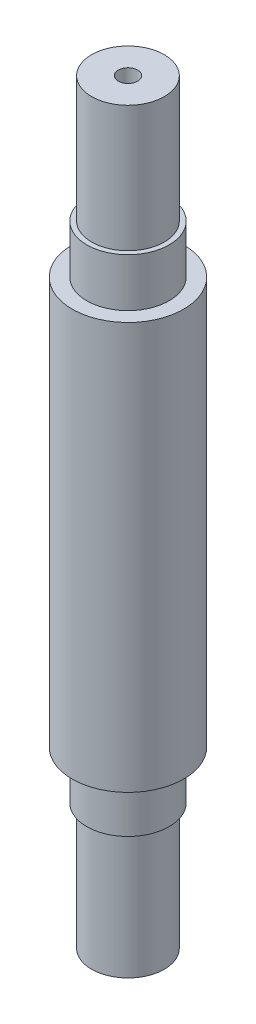
ISO-10303-21;
HEADER;
FILE_DESCRIPTION(('STEP AP214'),'2;1');
FILE_NAME('part.step','',(''),(''),'','','');
FILE_SCHEMA(('AUTOMOTIVE_DESIGN { 1 0 10303 214 1 1 1 1 }'));
ENDSEC;
DATA;
#1=APPLICATION_CONTEXT('core data for automotive mechanical design processes');
#2=APPLICATION_PROTOCOL_DEFINITION('international standard','automotive_design',2000,#1);
#3=PRODUCT_CONTEXT('',#1,'mechanical');
#4=PRODUCT('Part','Part','',(#3));
#5=PRODUCT_RELATED_PRODUCT_CATEGORY('part','',(#4));
#6=PRODUCT_DEFINITION_FORMATION('','',#4);
#7=PRODUCT_DEFINITION_CONTEXT('part definition',#1,'design');
#8=PRODUCT_DEFINITION('design','',#6,#7);
#9=PRODUCT_DEFINITION_SHAPE('','',#8);
#10=(LENGTH_UNIT() NAMED_UNIT(*) SI_UNIT(.MILLI.,.METRE.));
#11=(NAMED_UNIT(*) PLANE_ANGLE_UNIT() SI_UNIT($,.RADIAN.));
#12=(NAMED_UNIT(*) SI_UNIT($,.STERADIAN.) SOLID_ANGLE_UNIT());
#13=UNCERTAINTY_MEASURE_WITH_UNIT(LENGTH_MEASURE(1.E-05),#10,'distance_accuracy_value','');
#14=(GEOMETRIC_REPRESENTATION_CONTEXT(3) GLOBAL_UNCERTAINTY_ASSIGNED_CONTEXT((#13)) GLOBAL_UNIT_ASSIGNED_CONTEXT((#10,
#11,#12)) REPRESENTATION_CONTEXT('',''));
#15=CARTESIAN_POINT('',(0.,0.,0.));
#16=DIRECTION('',(0.,0.,1.));
#17=DIRECTION('',(1.,0.,0.));
#18=AXIS2_PLACEMENT_3D('',#15,#16,#17);
#19=CARTESIAN_POINT('',(0.,29.4619524825848,0.));
#20=DIRECTION('',(0.,1.,0.));
#21=DIRECTION('',(-1.,0.,0.));
#22=AXIS2_PLACEMENT_3D('',#19,#20,#21);
#23=CONICAL_SURFACE('',#22,1.00000000000001,0.78539816339744);
#24=CARTESIAN_POINT('',(0.,28.4619524825848,0.));
#25=VERTEX_POINT('',#24);
#26=VERTEX_LOOP('',#25);
#27=FACE_BOUND('',#26,.T.);
#28=CARTESIAN_POINT('',(0.,29.4619524825848,0.));
#29=DIRECTION('',(0.,1.,0.));
#30=DIRECTION('',(-1.,0.,0.));
#31=AXIS2_PLACEMENT_3D('',#28,#29,#30);
#32=CIRCLE('',#31,1.00000000000001);
#33=CARTESIAN_POINT('',(-1.00000000000001,29.4619524825848,0.));
#34=VERTEX_POINT('',#33);
#35=EDGE_CURVE('E11',#34,#34,#32,.T.);
#36=ORIENTED_EDGE('',*,*,#35,.T.);
#37=EDGE_LOOP('',(#36));
#38=FACE_BOUND('',#37,.T.);
#39=ADVANCED_FACE('F36',(#27,#38),#23,.F.);
#40=CARTESIAN_POINT('',(0.,28.4619524825848,0.));
#41=DIRECTION('',(0.,1.,0.));
#42=DIRECTION('',(-1.,0.,0.));
#43=AXIS2_PLACEMENT_3D('',#40,#41,#42);
#44=CYLINDRICAL_SURFACE('',#43,1.00000000000001);
#45=ORIENTED_EDGE('',*,*,#35,.F.);
#46=EDGE_LOOP('',(#45));
#47=FACE_BOUND('',#46,.T.);
#48=CARTESIAN_POINT('',(0.,32.4619524825848,0.));
#49=DIRECTION('',(0.,1.,0.));
#50=DIRECTION('',(-1.,0.,0.));
#51=AXIS2_PLACEMENT_3D('',#48,#49,#50);
#52=CIRCLE('',#51,1.00000000000001);
#53=CARTESIAN_POINT('',(-1.00000000000001,32.4619524825848,0.));
#54=VERTEX_POINT('',#53);
#55=EDGE_CURVE('E43',#54,#54,#52,.T.);
#56=ORIENTED_EDGE('',*,*,#55,.T.);
#57=EDGE_LOOP('',(#56));
#58=FACE_BOUND('',#57,.T.);
#59=ADVANCED_FACE('F51',(#47,#58),#44,.F.);
#60=CARTESIAN_POINT('',(1.00000000000001,32.4619524825848,0.));
#61=DIRECTION('',(0.,-1.,0.));
#62=DIRECTION('',(1.,0.,0.));
#63=AXIS2_PLACEMENT_3D('',#60,#61,#62);
#64=PLANE('',#63);
#65=ORIENTED_EDGE('',*,*,#55,.F.);
#66=EDGE_LOOP('',(#65));
#67=FACE_BOUND('',#66,.T.);
#68=CARTESIAN_POINT('',(0.,32.4619524825848,0.));
#69=DIRECTION('',(0.,1.,0.));
#70=DIRECTION('',(-1.,0.,0.));
#71=AXIS2_PLACEMENT_3D('',#68,#69,#70);
#72=CIRCLE('',#71,3.75);
#73=CARTESIAN_POINT('',(-3.75,32.4619524825848,0.));
#74=VERTEX_POINT('',#73);
#75=EDGE_CURVE('E60',#74,#74,#72,.T.);
#76=ORIENTED_EDGE('',*,*,#75,.T.);
#77=EDGE_LOOP('',(#76));
#78=FACE_BOUND('',#77,.T.);
#79=ADVANCED_FACE('F56',(#67,#78),#64,.F.);
#80=CARTESIAN_POINT('',(0.,28.4619524825848,0.));
#81=DIRECTION('',(0.,1.,0.));
#82=DIRECTION('',(-1.,0.,0.));
#83=AXIS2_PLACEMENT_3D('',#80,#81,#82);
#84=CYLINDRICAL_SURFACE('',#83,3.75);
#85=ORIENTED_EDGE('',*,*,#75,.F.);
#86=EDGE_LOOP('',(#85));
#87=FACE_BOUND('',#86,.T.);
#88=CARTESIAN_POINT('',(0.,19.4619524825848,0.));
#89=DIRECTION('',(0.,1.,0.));
#90=DIRECTION('',(-1.,0.,0.));
#91=AXIS2_PLACEMENT_3D('',#88,#89,#90);
#92=CIRCLE('',#91,3.75);
#93=CARTESIAN_POINT('',(-3.75,19.4619524825848,0.));
#94=VERTEX_POINT('',#93);
#95=EDGE_CURVE('E62',#94,#94,#92,.T.);
#96=ORIENTED_EDGE('',*,*,#95,.T.);
#97=EDGE_LOOP('',(#96));
#98=FACE_BOUND('',#97,.T.);
#99=ADVANCED_FACE('F144',(#87,#98),#84,.T.);
#100=CARTESIAN_POINT('',(4.25,19.4619524825848,0.));
#101=DIRECTION('',(0.,-1.,0.));
#102=DIRECTION('',(1.,0.,0.));
#103=AXIS2_PLACEMENT_3D('',#100,#101,#102);
#104=PLANE('',#103);
#105=ORIENTED_EDGE('',*,*,#95,.F.);
#106=EDGE_LOOP('',(#105));
#107=FACE_BOUND('',#106,.T.);
#108=CARTESIAN_POINT('',(0.,19.4619524825848,0.));
#109=DIRECTION('',(0.,1.,0.));
#110=DIRECTION('',(-1.,0.,0.));
#111=AXIS2_PLACEMENT_3D('',#108,#109,#110);
#112=CIRCLE('',#111,4.25);
#113=CARTESIAN_POINT('',(-4.25,19.4619524825848,0.));
#114=VERTEX_POINT('',#113);
#115=EDGE_CURVE('E67',#114,#114,#112,.T.);
#116=ORIENTED_EDGE('',*,*,#115,.T.);
#117=EDGE_LOOP('',(#116));
#118=FACE_BOUND('',#117,.T.);
#119=ADVANCED_FACE('F140',(#107,#118),#104,.F.);
#120=CARTESIAN_POINT('',(0.,28.4619524825848,0.));
#121=DIRECTION('',(0.,1.,0.));
#122=DIRECTION('',(-1.,0.,0.));
#123=AXIS2_PLACEMENT_3D('',#120,#121,#122);
#124=CYLINDRICAL_SURFACE('',#123,4.25);
#125=ORIENTED_EDGE('',*,*,#115,.F.);
#126=EDGE_LOOP('',(#125));
#127=FACE_BOUND('',#126,.T.);
#128=CARTESIAN_POINT('',(0.,14.4619524825848,0.));
#129=DIRECTION('',(0.,1.,0.));
#130=DIRECTION('',(-1.,0.,0.));
#131=AXIS2_PLACEMENT_3D('',#128,#129,#130);
#132=CIRCLE('',#131,4.25);
#133=CARTESIAN_POINT('',(-4.25,14.4619524825848,0.));
#134=VERTEX_POINT('',#133);
#135=EDGE_CURVE('E70',#134,#134,#132,.T.);
#136=ORIENTED_EDGE('',*,*,#135,.T.);
#137=EDGE_LOOP('',(#136));
#138=FACE_BOUND('',#137,.T.);
#139=ADVANCED_FACE('F136',(#127,#138),#124,.T.);
#140=CARTESIAN_POINT('',(4.25,14.4619524825848,0.));
#141=DIRECTION('',(0.,-1.,0.));
#142=DIRECTION('',(1.,0.,0.));
#143=AXIS2_PLACEMENT_3D('',#140,#141,#142);
#144=PLANE('',#143);
#145=ORIENTED_EDGE('',*,*,#135,.F.);
#146=EDGE_LOOP('',(#145));
#147=FACE_BOUND('',#146,.T.);
#148=CARTESIAN_POINT('',(0.,14.4619524825848,0.));
#149=DIRECTION('',(0.,1.,0.));
#150=DIRECTION('',(-1.,0.,0.));
#151=AXIS2_PLACEMENT_3D('',#148,#149,#150);
#152=CIRCLE('',#151,5.75);
#153=CARTESIAN_POINT('',(-5.75,14.4619524825848,0.));
#154=VERTEX_POINT('',#153);
#155=EDGE_CURVE('E73',#154,#154,#152,.T.);
#156=ORIENTED_EDGE('',*,*,#155,.T.);
#157=EDGE_LOOP('',(#156));
#158=FACE_BOUND('',#157,.T.);
#159=ADVANCED_FACE('F132',(#147,#158),#144,.F.);
#160=CARTESIAN_POINT('',(0.,28.4619524825848,0.));
#161=DIRECTION('',(0.,1.,0.));
#162=DIRECTION('',(-1.,0.,0.));
#163=AXIS2_PLACEMENT_3D('',#160,#161,#162);
#164=CYLINDRICAL_SURFACE('',#163,5.75);
#165=ORIENTED_EDGE('',*,*,#155,.F.);
#166=EDGE_LOOP('',(#165));
#167=FACE_BOUND('',#166,.T.);
#168=CARTESIAN_POINT('',(0.,-27.5380475174152,0.));
#169=DIRECTION('',(0.,1.,0.));
#170=DIRECTION('',(-1.,0.,0.));
#171=AXIS2_PLACEMENT_3D('',#168,#169,#170);
#172=CIRCLE('',#171,5.75000000000001);
#173=CARTESIAN_POINT('',(-5.75000000000001,-27.5380475174152,0.));
#174=VERTEX_POINT('',#173);
#175=EDGE_CURVE('E76',#174,#174,#172,.T.);
#176=ORIENTED_EDGE('',*,*,#175,.T.);
#177=EDGE_LOOP('',(#176));
#178=FACE_BOUND('',#177,.T.);
#179=ADVANCED_FACE('F128',(#167,#178),#164,.T.);
#180=CARTESIAN_POINT('',(5.75000000000001,-27.5380475174152,0.));
#181=DIRECTION('',(0.,1.,0.));
#182=DIRECTION('',(-1.,0.,0.));
#183=AXIS2_PLACEMENT_3D('',#180,#181,#182);
#184=PLANE('',#183);
#185=ORIENTED_EDGE('',*,*,#175,.F.);
#186=EDGE_LOOP('',(#185));
#187=FACE_BOUND('',#186,.T.);
#188=CARTESIAN_POINT('',(0.,-27.5380475174152,0.));
#189=DIRECTION('',(0.,1.,0.));
#190=DIRECTION('',(-1.,0.,0.));
#191=AXIS2_PLACEMENT_3D('',#188,#189,#190);
#192=CIRCLE('',#191,4.25000000000001);
#193=CARTESIAN_POINT('',(-4.25000000000001,-27.5380475174152,0.));
#194=VERTEX_POINT('',#193);
#195=EDGE_CURVE('E79',#194,#194,#192,.T.);
#196=ORIENTED_EDGE('',*,*,#195,.T.);
#197=EDGE_LOOP('',(#196));
#198=FACE_BOUND('',#197,.T.);
#199=ADVANCED_FACE('F124',(#187,#198),#184,.F.);
#200=CARTESIAN_POINT('',(0.,28.4619524825848,0.));
#201=DIRECTION('',(0.,1.,0.));
#202=DIRECTION('',(-1.,0.,0.));
#203=AXIS2_PLACEMENT_3D('',#200,#201,#202);
#204=CYLINDRICAL_SURFACE('',#203,4.25000000000001);
#205=ORIENTED_EDGE('',*,*,#195,.F.);
#206=EDGE_LOOP('',(#205));
#207=FACE_BOUND('',#206,.T.);
#208=CARTESIAN_POINT('',(0.,-32.5380475174152,0.));
#209=DIRECTION('',(0.,1.,0.));
#210=DIRECTION('',(-1.,0.,0.));
#211=AXIS2_PLACEMENT_3D('',#208,#209,#210);
#212=CIRCLE('',#211,4.25000000000001);
#213=CARTESIAN_POINT('',(-4.25000000000001,-32.5380475174152,0.));
#214=VERTEX_POINT('',#213);
#215=EDGE_CURVE('E82',#214,#214,#212,.T.);
#216=ORIENTED_EDGE('',*,*,#215,.T.);
#217=EDGE_LOOP('',(#216));
#218=FACE_BOUND('',#217,.T.);
#219=ADVANCED_FACE('F120',(#207,#218),#204,.T.);
#220=CARTESIAN_POINT('',(4.25000000000001,-32.5380475174152,0.));
#221=DIRECTION('',(0.,1.,0.));
#222=DIRECTION('',(-1.,0.,0.));
#223=AXIS2_PLACEMENT_3D('',#220,#221,#222);
#224=PLANE('',#223);
#225=ORIENTED_EDGE('',*,*,#215,.F.);
#226=EDGE_LOOP('',(#225));
#227=FACE_BOUND('',#226,.T.);
#228=CARTESIAN_POINT('',(0.,-32.5380475174152,0.));
#229=DIRECTION('',(0.,1.,0.));
#230=DIRECTION('',(-1.,0.,0.));
#231=AXIS2_PLACEMENT_3D('',#228,#229,#230);
#232=CIRCLE('',#231,3.75);
#233=CARTESIAN_POINT('',(-3.75,-32.5380475174152,0.));
#234=VERTEX_POINT('',#233);
#235=EDGE_CURVE('E85',#234,#234,#232,.T.);
#236=ORIENTED_EDGE('',*,*,#235,.T.);
#237=EDGE_LOOP('',(#236));
#238=FACE_BOUND('',#237,.T.);
#239=ADVANCED_FACE('F116',(#227,#238),#224,.F.);
#240=CARTESIAN_POINT('',(0.,28.4619524825848,0.));
#241=DIRECTION('',(0.,1.,0.));
#242=DIRECTION('',(-1.,0.,0.));
#243=AXIS2_PLACEMENT_3D('',#240,#241,#242);
#244=CYLINDRICAL_SURFACE('',#243,3.75);
#245=ORIENTED_EDGE('',*,*,#235,.F.);
#246=EDGE_LOOP('',(#245));
#247=FACE_BOUND('',#246,.T.);
#248=CARTESIAN_POINT('',(0.,-45.5380475174152,0.));
#249=DIRECTION('',(0.,1.,0.));
#250=DIRECTION('',(-1.,0.,0.));
#251=AXIS2_PLACEMENT_3D('',#248,#249,#250);
#252=CIRCLE('',#251,3.75);
#253=CARTESIAN_POINT('',(-3.75,-45.5380475174152,0.));
#254=VERTEX_POINT('',#253);
#255=EDGE_CURVE('E88',#254,#254,#252,.T.);
#256=ORIENTED_EDGE('',*,*,#255,.T.);
#257=EDGE_LOOP('',(#256));
#258=FACE_BOUND('',#257,.T.);
#259=ADVANCED_FACE('F112',(#247,#258),#244,.T.);
#260=CARTESIAN_POINT('',(3.75,-45.5380475174152,0.));
#261=DIRECTION('',(0.,1.,0.));
#262=DIRECTION('',(-1.,0.,0.));
#263=AXIS2_PLACEMENT_3D('',#260,#261,#262);
#264=PLANE('',#263);
#265=ORIENTED_EDGE('',*,*,#255,.F.);
#266=EDGE_LOOP('',(#265));
#267=FACE_BOUND('',#266,.T.);
#268=CARTESIAN_POINT('',(0.,-45.5380475174152,0.));
#269=DIRECTION('',(0.,1.,0.));
#270=DIRECTION('',(-1.,0.,0.));
#271=AXIS2_PLACEMENT_3D('',#268,#269,#270);
#272=CIRCLE('',#271,1.00000000000003);
#273=CARTESIAN_POINT('',(-1.00000000000003,-45.5380475174152,0.));
#274=VERTEX_POINT('',#273);
#275=EDGE_CURVE('E91',#274,#274,#272,.T.);
#276=ORIENTED_EDGE('',*,*,#275,.T.);
#277=EDGE_LOOP('',(#276));
#278=FACE_BOUND('',#277,.T.);
#279=ADVANCED_FACE('F106',(#267,#278),#264,.F.);
#280=CARTESIAN_POINT('',(0.,28.4619524825848,0.));
#281=DIRECTION('',(0.,1.,0.));
#282=DIRECTION('',(-1.,0.,0.));
#283=AXIS2_PLACEMENT_3D('',#280,#281,#282);
#284=CYLINDRICAL_SURFACE('',#283,1.00000000000003);
#285=ORIENTED_EDGE('',*,*,#275,.F.);
#286=EDGE_LOOP('',(#285));
#287=FACE_BOUND('',#286,.T.);
#288=CARTESIAN_POINT('',(0.,-42.5380475174152,0.));
#289=DIRECTION('',(0.,1.,0.));
#290=DIRECTION('',(-1.,0.,0.));
#291=AXIS2_PLACEMENT_3D('',#288,#289,#290);
#292=CIRCLE('',#291,1.00000000000003);
#293=CARTESIAN_POINT('',(-1.00000000000003,-42.5380475174152,0.));
#294=VERTEX_POINT('',#293);
#295=EDGE_CURVE('E94',#294,#294,#292,.T.);
#296=ORIENTED_EDGE('',*,*,#295,.T.);
#297=EDGE_LOOP('',(#296));
#298=FACE_BOUND('',#297,.T.);
#299=ADVANCED_FACE('F98',(#287,#298),#284,.F.);
#300=CARTESIAN_POINT('',(0.,-41.7047945985163,0.));
#301=DIRECTION('',(0.,-1.,0.));
#302=DIRECTION('',(1.,0.,0.));
#303=AXIS2_PLACEMENT_3D('',#300,#301,#302);
#304=CONICAL_SURFACE('',#303,0.,0.876105510174119);
#305=ORIENTED_EDGE('',*,*,#295,.F.);
#306=EDGE_LOOP('',(#305));
#307=FACE_BOUND('',#306,.T.);
#308=CARTESIAN_POINT('',(0.,-41.7047945985163,0.));
#309=VERTEX_POINT('',#308);
#310=VERTEX_LOOP('',#309);
#311=FACE_BOUND('',#310,.T.);
#312=ADVANCED_FACE('F100',(#307,#311),#304,.F.);
#313=CLOSED_SHELL('',(#39,#59,#79,#99,#119,#139,#159,#179,#199,#219,#239,#259,#279,#299,#312));
#314=MANIFOLD_SOLID_BREP('B2',#313);
#315=ADVANCED_BREP_SHAPE_REPRESENTATION('',(#18,#314),#14);
#316=SHAPE_DEFINITION_REPRESENTATION(#9,#315);
ENDSEC;
END-ISO-10303-21;
